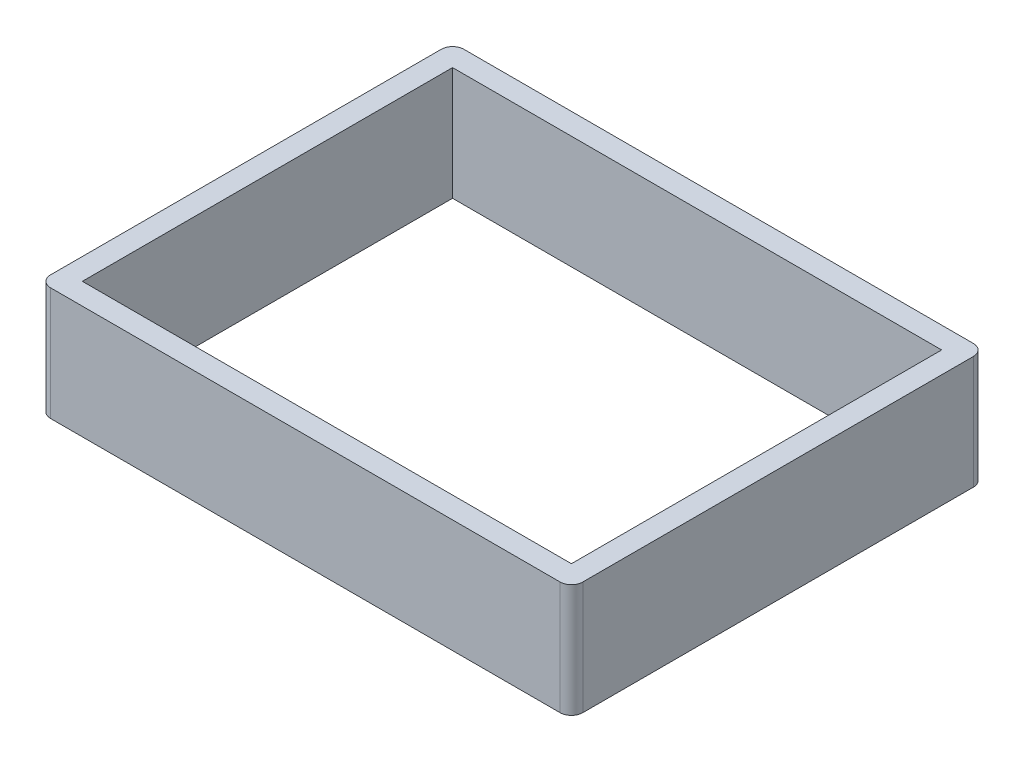
ISO-10303-21;
HEADER;
FILE_DESCRIPTION(('STEP AP214'),'2;1');
FILE_NAME('part.step','',(''),(''),'','','');
FILE_SCHEMA(('AUTOMOTIVE_DESIGN { 1 0 10303 214 1 1 1 1 }'));
ENDSEC;
DATA;
#1=APPLICATION_CONTEXT('core data for automotive mechanical design processes');
#2=APPLICATION_PROTOCOL_DEFINITION('international standard','automotive_design',2000,#1);
#3=PRODUCT_CONTEXT('',#1,'mechanical');
#4=PRODUCT('Part','Part','',(#3));
#5=PRODUCT_RELATED_PRODUCT_CATEGORY('part','',(#4));
#6=PRODUCT_DEFINITION_FORMATION('','',#4);
#7=PRODUCT_DEFINITION_CONTEXT('part definition',#1,'design');
#8=PRODUCT_DEFINITION('design','',#6,#7);
#9=PRODUCT_DEFINITION_SHAPE('','',#8);
#10=(LENGTH_UNIT() NAMED_UNIT(*) SI_UNIT(.MILLI.,.METRE.));
#11=(NAMED_UNIT(*) PLANE_ANGLE_UNIT() SI_UNIT($,.RADIAN.));
#12=(NAMED_UNIT(*) SI_UNIT($,.STERADIAN.) SOLID_ANGLE_UNIT());
#13=UNCERTAINTY_MEASURE_WITH_UNIT(LENGTH_MEASURE(1.E-05),#10,'distance_accuracy_value','');
#14=(GEOMETRIC_REPRESENTATION_CONTEXT(3) GLOBAL_UNCERTAINTY_ASSIGNED_CONTEXT((#13)) GLOBAL_UNIT_ASSIGNED_CONTEXT((#10,
#11,#12)) REPRESENTATION_CONTEXT('',''));
#15=CARTESIAN_POINT('',(0.,0.,0.));
#16=DIRECTION('',(0.,0.,1.));
#17=DIRECTION('',(1.,0.,0.));
#18=AXIS2_PLACEMENT_3D('',#15,#16,#17);
#19=CARTESIAN_POINT('',(0.,25.4,0.));
#20=DIRECTION('',(0.,-1.,0.));
#21=DIRECTION('',(0.,0.,-1.));
#22=AXIS2_PLACEMENT_3D('',#19,#20,#21);
#23=PLANE('',#22);
#24=DIRECTION('',(1.,0.,0.));
#25=VECTOR('',#24,1.);
#26=CARTESIAN_POINT('',(0.,25.4,0.));
#27=LINE('',#26,#25);
#28=CARTESIAN_POINT('',(2.54,25.4,0.));
#29=VERTEX_POINT('',#28);
#30=CARTESIAN_POINT('',(116.84,25.4,0.));
#31=VERTEX_POINT('',#30);
#32=EDGE_CURVE('E188',#29,#31,#27,.T.);
#33=ORIENTED_EDGE('',*,*,#32,.T.);
#34=CARTESIAN_POINT('',(116.84,25.4,-2.54));
#35=DIRECTION('',(0.,-1.,0.));
#36=DIRECTION('',(0.,0.,-1.));
#37=AXIS2_PLACEMENT_3D('',#34,#35,#36);
#38=CIRCLE('',#37,2.54);
#39=CARTESIAN_POINT('',(119.38,25.4,-2.54));
#40=VERTEX_POINT('',#39);
#41=EDGE_CURVE('E246',#31,#40,#38,.F.);
#42=ORIENTED_EDGE('',*,*,#41,.T.);
#43=DIRECTION('',(0.,0.,-1.));
#44=VECTOR('',#43,1.);
#45=CARTESIAN_POINT('',(119.38,25.4,0.));
#46=LINE('',#45,#44);
#47=CARTESIAN_POINT('',(119.38,25.4,-90.17));
#48=VERTEX_POINT('',#47);
#49=EDGE_CURVE('E193',#40,#48,#46,.T.);
#50=ORIENTED_EDGE('',*,*,#49,.T.);
#51=CARTESIAN_POINT('',(116.84,25.4,-90.17));
#52=DIRECTION('',(0.,-1.,0.));
#53=DIRECTION('',(0.,0.,-1.));
#54=AXIS2_PLACEMENT_3D('',#51,#52,#53);
#55=CIRCLE('',#54,2.54);
#56=CARTESIAN_POINT('',(116.84,25.4,-92.71));
#57=VERTEX_POINT('',#56);
#58=EDGE_CURVE('E61',#48,#57,#55,.F.);
#59=ORIENTED_EDGE('',*,*,#58,.T.);
#60=DIRECTION('',(-1.,0.,0.));
#61=VECTOR('',#60,1.);
#62=CARTESIAN_POINT('',(0.,25.4,-92.71));
#63=LINE('',#62,#61);
#64=CARTESIAN_POINT('',(2.53999999999999,25.4,-92.71));
#65=VERTEX_POINT('',#64);
#66=EDGE_CURVE('E196',#57,#65,#63,.T.);
#67=ORIENTED_EDGE('',*,*,#66,.T.);
#68=CARTESIAN_POINT('',(2.53999999999999,25.4,-90.17));
#69=DIRECTION('',(0.,-1.,0.));
#70=DIRECTION('',(0.,0.,-1.));
#71=AXIS2_PLACEMENT_3D('',#68,#69,#70);
#72=CIRCLE('',#71,2.54);
#73=CARTESIAN_POINT('',(0.,25.4,-90.17));
#74=VERTEX_POINT('',#73);
#75=EDGE_CURVE('E238',#65,#74,#72,.F.);
#76=ORIENTED_EDGE('',*,*,#75,.T.);
#77=DIRECTION('',(0.,0.,1.));
#78=VECTOR('',#77,1.);
#79=CARTESIAN_POINT('',(0.,25.4,0.));
#80=LINE('',#79,#78);
#81=CARTESIAN_POINT('',(0.,25.4,-2.54));
#82=VERTEX_POINT('',#81);
#83=EDGE_CURVE('E184',#74,#82,#80,.T.);
#84=ORIENTED_EDGE('',*,*,#83,.T.);
#85=CARTESIAN_POINT('',(2.54,25.4,-2.54));
#86=DIRECTION('',(0.,-1.,0.));
#87=DIRECTION('',(0.,0.,-1.));
#88=AXIS2_PLACEMENT_3D('',#85,#86,#87);
#89=CIRCLE('',#88,2.54);
#90=EDGE_CURVE('E243',#82,#29,#89,.F.);
#91=ORIENTED_EDGE('',*,*,#90,.T.);
#92=EDGE_LOOP('',(#33,#42,#50,#59,#67,#76,#84,#91));
#93=FACE_BOUND('',#92,.T.);
#94=DIRECTION('',(0.,0.,1.));
#95=VECTOR('',#94,1.);
#96=CARTESIAN_POINT('',(4.826,25.4,-87.884));
#97=LINE('',#96,#95);
#98=CARTESIAN_POINT('',(4.826,25.4,-87.884));
#99=VERTEX_POINT('',#98);
#100=CARTESIAN_POINT('',(4.82600000000001,25.4,-4.826));
#101=VERTEX_POINT('',#100);
#102=EDGE_CURVE('E131',#99,#101,#97,.T.);
#103=ORIENTED_EDGE('',*,*,#102,.F.);
#104=DIRECTION('',(-1.,0.,0.));
#105=VECTOR('',#104,1.);
#106=CARTESIAN_POINT('',(4.826,25.4,-87.884));
#107=LINE('',#106,#105);
#108=CARTESIAN_POINT('',(114.554,25.4,-87.884));
#109=VERTEX_POINT('',#108);
#110=EDGE_CURVE('E160',#109,#99,#107,.T.);
#111=ORIENTED_EDGE('',*,*,#110,.F.);
#112=DIRECTION('',(0.,0.,-1.));
#113=VECTOR('',#112,1.);
#114=CARTESIAN_POINT('',(114.554,25.4,-87.884));
#115=LINE('',#114,#113);
#116=CARTESIAN_POINT('',(114.554,25.4,-4.826));
#117=VERTEX_POINT('',#116);
#118=EDGE_CURVE('E156',#117,#109,#115,.T.);
#119=ORIENTED_EDGE('',*,*,#118,.F.);
#120=DIRECTION('',(1.,0.,0.));
#121=VECTOR('',#120,1.);
#122=CARTESIAN_POINT('',(4.82600000000001,25.4,-4.826));
#123=LINE('',#122,#121);
#124=EDGE_CURVE('E142',#101,#117,#123,.T.);
#125=ORIENTED_EDGE('',*,*,#124,.F.);
#126=EDGE_LOOP('',(#103,#111,#119,#125));
#127=FACE_BOUND('',#126,.T.);
#128=ADVANCED_FACE('F39',(#93,#127),#23,.F.);
#129=CARTESIAN_POINT('',(0.,0.,0.));
#130=DIRECTION('',(0.,-1.,0.));
#131=DIRECTION('',(0.,0.,-1.));
#132=AXIS2_PLACEMENT_3D('',#129,#130,#131);
#133=PLANE('',#132);
#134=DIRECTION('',(0.,0.,-1.));
#135=VECTOR('',#134,1.);
#136=CARTESIAN_POINT('',(119.38,0.,0.));
#137=LINE('',#136,#135);
#138=CARTESIAN_POINT('',(119.38,0.,-2.54));
#139=VERTEX_POINT('',#138);
#140=CARTESIAN_POINT('',(119.38,0.,-90.17));
#141=VERTEX_POINT('',#140);
#142=EDGE_CURVE('E207',#139,#141,#137,.T.);
#143=ORIENTED_EDGE('',*,*,#142,.F.);
#144=CARTESIAN_POINT('',(116.84,0.,-2.54));
#145=DIRECTION('',(0.,-1.,0.));
#146=DIRECTION('',(0.,0.,-1.));
#147=AXIS2_PLACEMENT_3D('',#144,#145,#146);
#148=CIRCLE('',#147,2.54);
#149=CARTESIAN_POINT('',(116.84,0.,0.));
#150=VERTEX_POINT('',#149);
#151=EDGE_CURVE('E228',#139,#150,#148,.T.);
#152=ORIENTED_EDGE('',*,*,#151,.T.);
#153=DIRECTION('',(1.,0.,0.));
#154=VECTOR('',#153,1.);
#155=CARTESIAN_POINT('',(0.,0.,0.));
#156=LINE('',#155,#154);
#157=CARTESIAN_POINT('',(2.54,0.,0.));
#158=VERTEX_POINT('',#157);
#159=EDGE_CURVE('E203',#158,#150,#156,.T.);
#160=ORIENTED_EDGE('',*,*,#159,.F.);
#161=CARTESIAN_POINT('',(2.54,0.,-2.54));
#162=DIRECTION('',(0.,-1.,0.));
#163=DIRECTION('',(0.,0.,-1.));
#164=AXIS2_PLACEMENT_3D('',#161,#162,#163);
#165=CIRCLE('',#164,2.54);
#166=CARTESIAN_POINT('',(0.,0.,-2.54));
#167=VERTEX_POINT('',#166);
#168=EDGE_CURVE('E225',#158,#167,#165,.T.);
#169=ORIENTED_EDGE('',*,*,#168,.T.);
#170=DIRECTION('',(0.,0.,1.));
#171=VECTOR('',#170,1.);
#172=CARTESIAN_POINT('',(0.,0.,0.));
#173=LINE('',#172,#171);
#174=CARTESIAN_POINT('',(0.,0.,-90.17));
#175=VERTEX_POINT('',#174);
#176=EDGE_CURVE('E151',#175,#167,#173,.T.);
#177=ORIENTED_EDGE('',*,*,#176,.F.);
#178=CARTESIAN_POINT('',(2.53999999999999,0.,-90.17));
#179=DIRECTION('',(0.,-1.,0.));
#180=DIRECTION('',(0.,0.,-1.));
#181=AXIS2_PLACEMENT_3D('',#178,#179,#180);
#182=CIRCLE('',#181,2.54);
#183=CARTESIAN_POINT('',(2.53999999999999,0.,-92.71));
#184=VERTEX_POINT('',#183);
#185=EDGE_CURVE('E219',#175,#184,#182,.T.);
#186=ORIENTED_EDGE('',*,*,#185,.T.);
#187=DIRECTION('',(-1.,0.,0.));
#188=VECTOR('',#187,1.);
#189=CARTESIAN_POINT('',(0.,0.,-92.71));
#190=LINE('',#189,#188);
#191=CARTESIAN_POINT('',(116.84,0.,-92.71));
#192=VERTEX_POINT('',#191);
#193=EDGE_CURVE('E189',#192,#184,#190,.T.);
#194=ORIENTED_EDGE('',*,*,#193,.F.);
#195=CARTESIAN_POINT('',(116.84,0.,-90.17));
#196=DIRECTION('',(0.,-1.,0.));
#197=DIRECTION('',(0.,0.,-1.));
#198=AXIS2_PLACEMENT_3D('',#195,#196,#197);
#199=CIRCLE('',#198,2.54);
#200=EDGE_CURVE('E222',#192,#141,#199,.T.);
#201=ORIENTED_EDGE('',*,*,#200,.T.);
#202=EDGE_LOOP('',(#143,#152,#160,#169,#177,#186,#194,#201));
#203=FACE_BOUND('',#202,.T.);
#204=DIRECTION('',(-1.,0.,0.));
#205=VECTOR('',#204,1.);
#206=CARTESIAN_POINT('',(4.826,0.,-87.884));
#207=LINE('',#206,#205);
#208=CARTESIAN_POINT('',(114.554,0.,-87.884));
#209=VERTEX_POINT('',#208);
#210=CARTESIAN_POINT('',(4.826,0.,-87.884));
#211=VERTEX_POINT('',#210);
#212=EDGE_CURVE('E143',#209,#211,#207,.T.);
#213=ORIENTED_EDGE('',*,*,#212,.T.);
#214=DIRECTION('',(0.,0.,1.));
#215=VECTOR('',#214,1.);
#216=CARTESIAN_POINT('',(4.826,0.,-87.884));
#217=LINE('',#216,#215);
#218=CARTESIAN_POINT('',(4.82600000000001,0.,-4.826));
#219=VERTEX_POINT('',#218);
#220=EDGE_CURVE('E165',#211,#219,#217,.T.);
#221=ORIENTED_EDGE('',*,*,#220,.T.);
#222=DIRECTION('',(1.,0.,0.));
#223=VECTOR('',#222,1.);
#224=CARTESIAN_POINT('',(4.82600000000001,0.,-4.826));
#225=LINE('',#224,#223);
#226=CARTESIAN_POINT('',(114.554,0.,-4.826));
#227=VERTEX_POINT('',#226);
#228=EDGE_CURVE('E149',#219,#227,#225,.T.);
#229=ORIENTED_EDGE('',*,*,#228,.T.);
#230=DIRECTION('',(0.,0.,-1.));
#231=VECTOR('',#230,1.);
#232=CARTESIAN_POINT('',(114.554,0.,-87.884));
#233=LINE('',#232,#231);
#234=EDGE_CURVE('E170',#227,#209,#233,.T.);
#235=ORIENTED_EDGE('',*,*,#234,.T.);
#236=EDGE_LOOP('',(#213,#221,#229,#235));
#237=FACE_BOUND('',#236,.T.);
#238=ADVANCED_FACE('F274',(#203,#237),#133,.T.);
#239=CARTESIAN_POINT('',(0.,25.4,0.));
#240=DIRECTION('',(1.,0.,0.));
#241=DIRECTION('',(0.,0.,-1.));
#242=AXIS2_PLACEMENT_3D('',#239,#240,#241);
#243=PLANE('',#242);
#244=ORIENTED_EDGE('',*,*,#176,.T.);
#245=DIRECTION('',(0.,-1.,0.));
#246=VECTOR('',#245,1.);
#247=CARTESIAN_POINT('',(0.,25.4,-2.54));
#248=LINE('',#247,#246);
#249=EDGE_CURVE('E253',#167,#82,#248,.F.);
#250=ORIENTED_EDGE('',*,*,#249,.T.);
#251=ORIENTED_EDGE('',*,*,#83,.F.);
#252=DIRECTION('',(0.,-1.,0.));
#253=VECTOR('',#252,1.);
#254=CARTESIAN_POINT('',(0.,25.4,-90.17));
#255=LINE('',#254,#253);
#256=EDGE_CURVE('E249',#74,#175,#255,.T.);
#257=ORIENTED_EDGE('',*,*,#256,.T.);
#258=EDGE_LOOP('',(#244,#250,#251,#257));
#259=FACE_BOUND('',#258,.T.);
#260=ADVANCED_FACE('F259',(#259),#243,.F.);
#261=CARTESIAN_POINT('',(0.,25.4,0.));
#262=DIRECTION('',(0.,0.,-1.));
#263=DIRECTION('',(-1.,0.,0.));
#264=AXIS2_PLACEMENT_3D('',#261,#262,#263);
#265=PLANE('',#264);
#266=ORIENTED_EDGE('',*,*,#159,.T.);
#267=DIRECTION('',(0.,-1.,0.));
#268=VECTOR('',#267,1.);
#269=CARTESIAN_POINT('',(116.84,25.4,0.));
#270=LINE('',#269,#268);
#271=EDGE_CURVE('E235',#150,#31,#270,.F.);
#272=ORIENTED_EDGE('',*,*,#271,.T.);
#273=ORIENTED_EDGE('',*,*,#32,.F.);
#274=DIRECTION('',(0.,-1.,0.));
#275=VECTOR('',#274,1.);
#276=CARTESIAN_POINT('',(2.54,25.4,0.));
#277=LINE('',#276,#275);
#278=EDGE_CURVE('E231',#29,#158,#277,.T.);
#279=ORIENTED_EDGE('',*,*,#278,.T.);
#280=EDGE_LOOP('',(#266,#272,#273,#279));
#281=FACE_BOUND('',#280,.T.);
#282=ADVANCED_FACE('F270',(#281),#265,.F.);
#283=CARTESIAN_POINT('',(119.38,25.4,0.));
#284=DIRECTION('',(-1.,0.,0.));
#285=DIRECTION('',(0.,0.,1.));
#286=AXIS2_PLACEMENT_3D('',#283,#284,#285);
#287=PLANE('',#286);
#288=ORIENTED_EDGE('',*,*,#49,.F.);
#289=DIRECTION('',(0.,-1.,0.));
#290=VECTOR('',#289,1.);
#291=CARTESIAN_POINT('',(119.38,25.4,-2.54));
#292=LINE('',#291,#290);
#293=EDGE_CURVE('E215',#40,#139,#292,.T.);
#294=ORIENTED_EDGE('',*,*,#293,.T.);
#295=ORIENTED_EDGE('',*,*,#142,.T.);
#296=DIRECTION('',(0.,-1.,0.));
#297=VECTOR('',#296,1.);
#298=CARTESIAN_POINT('',(119.38,25.4,-90.17));
#299=LINE('',#298,#297);
#300=EDGE_CURVE('E199',#141,#48,#299,.F.);
#301=ORIENTED_EDGE('',*,*,#300,.T.);
#302=EDGE_LOOP('',(#288,#294,#295,#301));
#303=FACE_BOUND('',#302,.T.);
#304=ADVANCED_FACE('F282',(#303),#287,.F.);
#305=CARTESIAN_POINT('',(0.,25.4,-92.71));
#306=DIRECTION('',(0.,0.,1.));
#307=DIRECTION('',(1.,0.,0.));
#308=AXIS2_PLACEMENT_3D('',#305,#306,#307);
#309=PLANE('',#308);
#310=ORIENTED_EDGE('',*,*,#66,.F.);
#311=DIRECTION('',(0.,-1.,0.));
#312=VECTOR('',#311,1.);
#313=CARTESIAN_POINT('',(116.84,25.4,-92.71));
#314=LINE('',#313,#312);
#315=EDGE_CURVE('E11',#57,#192,#314,.T.);
#316=ORIENTED_EDGE('',*,*,#315,.T.);
#317=ORIENTED_EDGE('',*,*,#193,.T.);
#318=DIRECTION('',(0.,-1.,0.));
#319=VECTOR('',#318,1.);
#320=CARTESIAN_POINT('',(2.53999999999999,25.4,-92.71));
#321=LINE('',#320,#319);
#322=EDGE_CURVE('E48',#184,#65,#321,.F.);
#323=ORIENTED_EDGE('',*,*,#322,.T.);
#324=EDGE_LOOP('',(#310,#316,#317,#323));
#325=FACE_BOUND('',#324,.T.);
#326=ADVANCED_FACE('F288',(#325),#309,.F.);
#327=CARTESIAN_POINT('',(4.826,25.4,-87.884));
#328=DIRECTION('',(1.,0.,0.));
#329=DIRECTION('',(0.,0.,-1.));
#330=AXIS2_PLACEMENT_3D('',#327,#328,#329);
#331=PLANE('',#330);
#332=ORIENTED_EDGE('',*,*,#220,.F.);
#333=DIRECTION('',(0.,-1.,0.));
#334=VECTOR('',#333,1.);
#335=CARTESIAN_POINT('',(4.826,25.4,-87.884));
#336=LINE('',#335,#334);
#337=EDGE_CURVE('E137',#99,#211,#336,.T.);
#338=ORIENTED_EDGE('',*,*,#337,.F.);
#339=ORIENTED_EDGE('',*,*,#102,.T.);
#340=DIRECTION('',(0.,-1.,0.));
#341=VECTOR('',#340,1.);
#342=CARTESIAN_POINT('',(4.82600000000001,25.4,-4.826));
#343=LINE('',#342,#341);
#344=EDGE_CURVE('E134',#101,#219,#343,.T.);
#345=ORIENTED_EDGE('',*,*,#344,.T.);
#346=EDGE_LOOP('',(#332,#338,#339,#345));
#347=FACE_BOUND('',#346,.T.);
#348=ADVANCED_FACE('F133',(#347),#331,.T.);
#349=CARTESIAN_POINT('',(4.82600000000001,25.4,-4.826));
#350=DIRECTION('',(0.,0.,-1.));
#351=DIRECTION('',(-1.,0.,0.));
#352=AXIS2_PLACEMENT_3D('',#349,#350,#351);
#353=PLANE('',#352);
#354=ORIENTED_EDGE('',*,*,#228,.F.);
#355=ORIENTED_EDGE('',*,*,#344,.F.);
#356=ORIENTED_EDGE('',*,*,#124,.T.);
#357=DIRECTION('',(0.,-1.,0.));
#358=VECTOR('',#357,1.);
#359=CARTESIAN_POINT('',(114.554,25.4,-4.826));
#360=LINE('',#359,#358);
#361=EDGE_CURVE('E152',#117,#227,#360,.T.);
#362=ORIENTED_EDGE('',*,*,#361,.T.);
#363=EDGE_LOOP('',(#354,#355,#356,#362));
#364=FACE_BOUND('',#363,.T.);
#365=ADVANCED_FACE('F146',(#364),#353,.T.);
#366=CARTESIAN_POINT('',(114.554,25.4,-87.884));
#367=DIRECTION('',(-1.,0.,0.));
#368=DIRECTION('',(0.,0.,1.));
#369=AXIS2_PLACEMENT_3D('',#366,#367,#368);
#370=PLANE('',#369);
#371=ORIENTED_EDGE('',*,*,#234,.F.);
#372=ORIENTED_EDGE('',*,*,#361,.F.);
#373=ORIENTED_EDGE('',*,*,#118,.T.);
#374=DIRECTION('',(0.,-1.,0.));
#375=VECTOR('',#374,1.);
#376=CARTESIAN_POINT('',(114.554,25.4,-87.884));
#377=LINE('',#376,#375);
#378=EDGE_CURVE('E179',#109,#209,#377,.T.);
#379=ORIENTED_EDGE('',*,*,#378,.T.);
#380=EDGE_LOOP('',(#371,#372,#373,#379));
#381=FACE_BOUND('',#380,.T.);
#382=ADVANCED_FACE('F344',(#381),#370,.T.);
#383=CARTESIAN_POINT('',(4.826,25.4,-87.884));
#384=DIRECTION('',(0.,0.,1.));
#385=DIRECTION('',(1.,0.,0.));
#386=AXIS2_PLACEMENT_3D('',#383,#384,#385);
#387=PLANE('',#386);
#388=ORIENTED_EDGE('',*,*,#212,.F.);
#389=ORIENTED_EDGE('',*,*,#378,.F.);
#390=ORIENTED_EDGE('',*,*,#110,.T.);
#391=ORIENTED_EDGE('',*,*,#337,.T.);
#392=EDGE_LOOP('',(#388,#389,#390,#391));
#393=FACE_BOUND('',#392,.T.);
#394=ADVANCED_FACE('F313',(#393),#387,.T.);
#395=CARTESIAN_POINT('',(116.84,25.4,-2.54));
#396=DIRECTION('',(0.,-1.,0.));
#397=DIRECTION('',(0.,0.,-1.));
#398=AXIS2_PLACEMENT_3D('',#395,#396,#397);
#399=CYLINDRICAL_SURFACE('',#398,2.54);
#400=ORIENTED_EDGE('',*,*,#41,.F.);
#401=ORIENTED_EDGE('',*,*,#271,.F.);
#402=ORIENTED_EDGE('',*,*,#151,.F.);
#403=ORIENTED_EDGE('',*,*,#293,.F.);
#404=EDGE_LOOP('',(#400,#401,#402,#403));
#405=FACE_BOUND('',#404,.T.);
#406=ADVANCED_FACE('F279',(#405),#399,.T.);
#407=CARTESIAN_POINT('',(2.54,25.4,-2.54));
#408=DIRECTION('',(0.,-1.,0.));
#409=DIRECTION('',(0.,0.,-1.));
#410=AXIS2_PLACEMENT_3D('',#407,#408,#409);
#411=CYLINDRICAL_SURFACE('',#410,2.54);
#412=ORIENTED_EDGE('',*,*,#90,.F.);
#413=ORIENTED_EDGE('',*,*,#249,.F.);
#414=ORIENTED_EDGE('',*,*,#168,.F.);
#415=ORIENTED_EDGE('',*,*,#278,.F.);
#416=EDGE_LOOP('',(#412,#413,#414,#415));
#417=FACE_BOUND('',#416,.T.);
#418=ADVANCED_FACE('F267',(#417),#411,.T.);
#419=CARTESIAN_POINT('',(116.84,25.4,-90.17));
#420=DIRECTION('',(0.,-1.,0.));
#421=DIRECTION('',(0.,0.,-1.));
#422=AXIS2_PLACEMENT_3D('',#419,#420,#421);
#423=CYLINDRICAL_SURFACE('',#422,2.54);
#424=ORIENTED_EDGE('',*,*,#58,.F.);
#425=ORIENTED_EDGE('',*,*,#300,.F.);
#426=ORIENTED_EDGE('',*,*,#200,.F.);
#427=ORIENTED_EDGE('',*,*,#315,.F.);
#428=EDGE_LOOP('',(#424,#425,#426,#427));
#429=FACE_BOUND('',#428,.T.);
#430=ADVANCED_FACE('F286',(#429),#423,.T.);
#431=CARTESIAN_POINT('',(2.53999999999999,25.4,-90.17));
#432=DIRECTION('',(0.,-1.,0.));
#433=DIRECTION('',(0.,0.,-1.));
#434=AXIS2_PLACEMENT_3D('',#431,#432,#433);
#435=CYLINDRICAL_SURFACE('',#434,2.54);
#436=ORIENTED_EDGE('',*,*,#75,.F.);
#437=ORIENTED_EDGE('',*,*,#322,.F.);
#438=ORIENTED_EDGE('',*,*,#185,.F.);
#439=ORIENTED_EDGE('',*,*,#256,.F.);
#440=EDGE_LOOP('',(#436,#437,#438,#439));
#441=FACE_BOUND('',#440,.T.);
#442=ADVANCED_FACE('F41',(#441),#435,.T.);
#443=CLOSED_SHELL('',(#128,#238,#260,#282,#304,#326,#348,#365,#382,#394,#406,#418,#430,#442));
#444=MANIFOLD_SOLID_BREP('B2',#443);
#445=ADVANCED_BREP_SHAPE_REPRESENTATION('',(#18,#444),#14);
#446=SHAPE_DEFINITION_REPRESENTATION(#9,#445);
ENDSEC;
END-ISO-10303-21;
